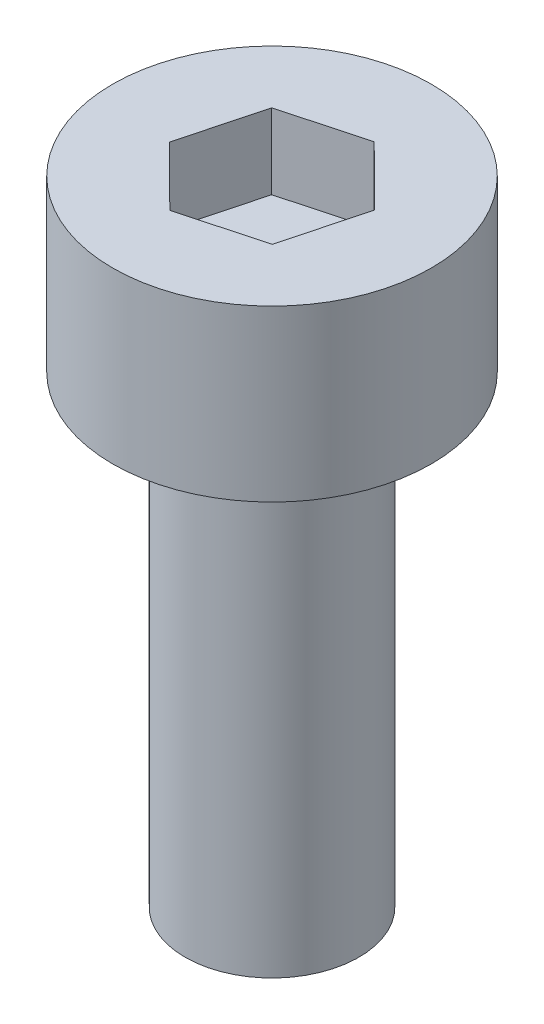
ISO-10303-21;
HEADER;
FILE_DESCRIPTION(('STEP AP214'),'2;1');
FILE_NAME('part.step','',(''),(''),'','','');
FILE_SCHEMA(('AUTOMOTIVE_DESIGN { 1 0 10303 214 1 1 1 1 }'));
ENDSEC;
DATA;
#1=APPLICATION_CONTEXT('core data for automotive mechanical design processes');
#2=APPLICATION_PROTOCOL_DEFINITION('international standard','automotive_design',2000,#1);
#3=PRODUCT_CONTEXT('',#1,'mechanical');
#4=PRODUCT('Part','Part','',(#3));
#5=PRODUCT_RELATED_PRODUCT_CATEGORY('part','',(#4));
#6=PRODUCT_DEFINITION_FORMATION('','',#4);
#7=PRODUCT_DEFINITION_CONTEXT('part definition',#1,'design');
#8=PRODUCT_DEFINITION('design','',#6,#7);
#9=PRODUCT_DEFINITION_SHAPE('','',#8);
#10=(LENGTH_UNIT() NAMED_UNIT(*) SI_UNIT(.MILLI.,.METRE.));
#11=(NAMED_UNIT(*) PLANE_ANGLE_UNIT() SI_UNIT($,.RADIAN.));
#12=(NAMED_UNIT(*) SI_UNIT($,.STERADIAN.) SOLID_ANGLE_UNIT());
#13=UNCERTAINTY_MEASURE_WITH_UNIT(LENGTH_MEASURE(1.E-05),#10,'distance_accuracy_value','');
#14=(GEOMETRIC_REPRESENTATION_CONTEXT(3) GLOBAL_UNCERTAINTY_ASSIGNED_CONTEXT((#13)) GLOBAL_UNIT_ASSIGNED_CONTEXT((#10,
#11,#12)) REPRESENTATION_CONTEXT('',''));
#15=CARTESIAN_POINT('',(0.,0.,0.));
#16=DIRECTION('',(0.,0.,1.));
#17=DIRECTION('',(1.,0.,0.));
#18=AXIS2_PLACEMENT_3D('',#15,#16,#17);
#19=CARTESIAN_POINT('',(0.,8.,0.));
#20=DIRECTION('',(0.,-1.,0.));
#21=DIRECTION('',(0.,0.,-1.));
#22=AXIS2_PLACEMENT_3D('',#19,#20,#21);
#23=CYLINDRICAL_SURFACE('',#22,1.5);
#24=CARTESIAN_POINT('',(0.,8.,0.));
#25=DIRECTION('',(0.,1.,0.));
#26=DIRECTION('',(0.,0.,1.));
#27=AXIS2_PLACEMENT_3D('',#24,#25,#26);
#28=CIRCLE('',#27,1.5);
#29=CARTESIAN_POINT('',(0.,8.,1.5));
#30=VERTEX_POINT('',#29);
#31=EDGE_CURVE('E11',#30,#30,#28,.T.);
#32=ORIENTED_EDGE('',*,*,#31,.F.);
#33=EDGE_LOOP('',(#32));
#34=FACE_BOUND('',#33,.T.);
#35=CARTESIAN_POINT('',(0.,0.,0.));
#36=DIRECTION('',(0.,1.,0.));
#37=DIRECTION('',(0.,0.,1.));
#38=AXIS2_PLACEMENT_3D('',#35,#36,#37);
#39=CIRCLE('',#38,1.5);
#40=CARTESIAN_POINT('',(0.,0.,1.5));
#41=VERTEX_POINT('',#40);
#42=EDGE_CURVE('E42',#41,#41,#39,.T.);
#43=ORIENTED_EDGE('',*,*,#42,.T.);
#44=EDGE_LOOP('',(#43));
#45=FACE_BOUND('',#44,.T.);
#46=ADVANCED_FACE('F39',(#34,#45),#23,.T.);
#47=CARTESIAN_POINT('',(0.,0.,0.));
#48=DIRECTION('',(0.,1.,0.));
#49=DIRECTION('',(0.,0.,1.));
#50=AXIS2_PLACEMENT_3D('',#47,#48,#49);
#51=PLANE('',#50);
#52=ORIENTED_EDGE('',*,*,#42,.F.);
#53=EDGE_LOOP('',(#52));
#54=FACE_BOUND('',#53,.T.);
#55=ADVANCED_FACE('F189',(#54),#51,.F.);
#56=CARTESIAN_POINT('',(0.,10.93,0.));
#57=DIRECTION('',(0.,-1.,0.));
#58=DIRECTION('',(0.,0.,-1.));
#59=AXIS2_PLACEMENT_3D('',#56,#57,#58);
#60=CYLINDRICAL_SURFACE('',#59,2.75);
#61=CARTESIAN_POINT('',(0.,10.93,0.));
#62=DIRECTION('',(0.,1.,0.));
#63=DIRECTION('',(0.,0.,1.));
#64=AXIS2_PLACEMENT_3D('',#61,#62,#63);
#65=CIRCLE('',#64,2.75);
#66=CARTESIAN_POINT('',(0.,10.93,2.75));
#67=VERTEX_POINT('',#66);
#68=EDGE_CURVE('E163',#67,#67,#65,.T.);
#69=ORIENTED_EDGE('',*,*,#68,.F.);
#70=EDGE_LOOP('',(#69));
#71=FACE_BOUND('',#70,.T.);
#72=CARTESIAN_POINT('',(0.,8.,0.));
#73=DIRECTION('',(0.,1.,0.));
#74=DIRECTION('',(0.,0.,1.));
#75=AXIS2_PLACEMENT_3D('',#72,#73,#74);
#76=CIRCLE('',#75,2.75);
#77=CARTESIAN_POINT('',(0.,8.,2.75));
#78=VERTEX_POINT('',#77);
#79=EDGE_CURVE('E153',#78,#78,#76,.T.);
#80=ORIENTED_EDGE('',*,*,#79,.T.);
#81=EDGE_LOOP('',(#80));
#82=FACE_BOUND('',#81,.T.);
#83=ADVANCED_FACE('F171',(#71,#82),#60,.T.);
#84=CARTESIAN_POINT('',(0.,10.93,0.));
#85=DIRECTION('',(0.,1.,0.));
#86=DIRECTION('',(0.,0.,1.));
#87=AXIS2_PLACEMENT_3D('',#84,#85,#86);
#88=PLANE('',#87);
#89=DIRECTION('',(0.965060636483616,0.,-0.262026654960595));
#90=VECTOR('',#89,1.);
#91=CARTESIAN_POINT('',(-0.368939204121915,10.93,1.39542724532497));
#92=LINE('',#91,#90);
#93=CARTESIAN_POINT('',(-0.368939204121915,10.93,1.39542724532497));
#94=VERTEX_POINT('',#93);
#95=CARTESIAN_POINT('',(1.0240058415234,10.93,1.01722434588407));
#96=VERTEX_POINT('',#95);
#97=EDGE_CURVE('E54',#94,#96,#92,.T.);
#98=ORIENTED_EDGE('',*,*,#97,.F.);
#99=DIRECTION('',(0.709452057906343,0.,0.704753699906893));
#100=VECTOR('',#99,1.);
#101=CARTESIAN_POINT('',(-1.39294504564532,10.93,0.378202899440891));
#102=LINE('',#101,#100);
#103=CARTESIAN_POINT('',(-1.39294504564532,10.93,0.378202899440891));
#104=VERTEX_POINT('',#103);
#105=EDGE_CURVE('E147',#104,#94,#102,.T.);
#106=ORIENTED_EDGE('',*,*,#105,.F.);
#107=DIRECTION('',(-0.255608578577273,0.,0.966780354867488));
#108=VECTOR('',#107,1.);
#109=CARTESIAN_POINT('',(-1.0240058415234,10.93,-1.01722434588407));
#110=LINE('',#109,#108);
#111=CARTESIAN_POINT('',(-1.0240058415234,10.93,-1.01722434588407));
#112=VERTEX_POINT('',#111);
#113=EDGE_CURVE('E144',#112,#104,#110,.T.);
#114=ORIENTED_EDGE('',*,*,#113,.F.);
#115=DIRECTION('',(-0.965060636483616,0.,0.262026654960595));
#116=VECTOR('',#115,1.);
#117=CARTESIAN_POINT('',(0.368939204121915,10.93,-1.39542724532496));
#118=LINE('',#117,#116);
#119=CARTESIAN_POINT('',(0.368939204121915,10.93,-1.39542724532496));
#120=VERTEX_POINT('',#119);
#121=EDGE_CURVE('E102',#120,#112,#118,.T.);
#122=ORIENTED_EDGE('',*,*,#121,.F.);
#123=DIRECTION('',(-0.709452057906343,0.,-0.704753699906893));
#124=VECTOR('',#123,1.);
#125=CARTESIAN_POINT('',(1.39294504564532,10.93,-0.378202899440891));
#126=LINE('',#125,#124);
#127=CARTESIAN_POINT('',(1.39294504564532,10.93,-0.378202899440891));
#128=VERTEX_POINT('',#127);
#129=EDGE_CURVE('E138',#128,#120,#126,.T.);
#130=ORIENTED_EDGE('',*,*,#129,.F.);
#131=DIRECTION('',(0.255608578577273,0.,-0.966780354867488));
#132=VECTOR('',#131,1.);
#133=CARTESIAN_POINT('',(1.0240058415234,10.93,1.01722434588407));
#134=LINE('',#133,#132);
#135=EDGE_CURVE('E134',#96,#128,#134,.T.);
#136=ORIENTED_EDGE('',*,*,#135,.F.);
#137=EDGE_LOOP('',(#98,#106,#114,#122,#130,#136));
#138=FACE_BOUND('',#137,.T.);
#139=ORIENTED_EDGE('',*,*,#68,.T.);
#140=EDGE_LOOP('',(#139));
#141=FACE_BOUND('',#140,.T.);
#142=ADVANCED_FACE('F176',(#138,#141),#88,.T.);
#143=CARTESIAN_POINT('',(0.,8.,0.));
#144=DIRECTION('',(0.,1.,0.));
#145=DIRECTION('',(0.,0.,1.));
#146=AXIS2_PLACEMENT_3D('',#143,#144,#145);
#147=PLANE('',#146);
#148=ORIENTED_EDGE('',*,*,#31,.T.);
#149=EDGE_LOOP('',(#148));
#150=FACE_BOUND('',#149,.T.);
#151=ORIENTED_EDGE('',*,*,#79,.F.);
#152=EDGE_LOOP('',(#151));
#153=FACE_BOUND('',#152,.T.);
#154=ADVANCED_FACE('F173',(#150,#153),#147,.F.);
#155=CARTESIAN_POINT('',(-0.368939204121915,9.63,1.39542724532497));
#156=DIRECTION('',(0.262026654960595,0.,0.965060636483616));
#157=DIRECTION('',(0.965060636483616,0.,-0.262026654960595));
#158=AXIS2_PLACEMENT_3D('',#155,#156,#157);
#159=PLANE('',#158);
#160=ORIENTED_EDGE('',*,*,#97,.T.);
#161=DIRECTION('',(0.,1.,0.));
#162=VECTOR('',#161,1.);
#163=CARTESIAN_POINT('',(1.0240058415234,9.63,1.01722434588407));
#164=LINE('',#163,#162);
#165=CARTESIAN_POINT('',(1.0240058415234,9.63,1.01722434588407));
#166=VERTEX_POINT('',#165);
#167=EDGE_CURVE('E84',#166,#96,#164,.T.);
#168=ORIENTED_EDGE('',*,*,#167,.F.);
#169=DIRECTION('',(0.965060636483616,0.,-0.262026654960595));
#170=VECTOR('',#169,1.);
#171=CARTESIAN_POINT('',(-0.368939204121915,9.63,1.39542724532497));
#172=LINE('',#171,#170);
#173=CARTESIAN_POINT('',(-0.368939204121915,9.63,1.39542724532497));
#174=VERTEX_POINT('',#173);
#175=EDGE_CURVE('E150',#174,#166,#172,.T.);
#176=ORIENTED_EDGE('',*,*,#175,.F.);
#177=DIRECTION('',(0.,1.,0.));
#178=VECTOR('',#177,1.);
#179=CARTESIAN_POINT('',(-0.368939204121915,9.63,1.39542724532497));
#180=LINE('',#179,#178);
#181=EDGE_CURVE('E62',#174,#94,#180,.T.);
#182=ORIENTED_EDGE('',*,*,#181,.T.);
#183=EDGE_LOOP('',(#160,#168,#176,#182));
#184=FACE_BOUND('',#183,.T.);
#185=ADVANCED_FACE('F175',(#184),#159,.F.);
#186=CARTESIAN_POINT('',(-1.39294504564532,9.63,0.378202899440891));
#187=DIRECTION('',(-0.704753699906893,0.,0.709452057906343));
#188=DIRECTION('',(0.709452057906343,0.,0.704753699906893));
#189=AXIS2_PLACEMENT_3D('',#186,#187,#188);
#190=PLANE('',#189);
#191=ORIENTED_EDGE('',*,*,#105,.T.);
#192=ORIENTED_EDGE('',*,*,#181,.F.);
#193=DIRECTION('',(0.709452057906343,0.,0.704753699906893));
#194=VECTOR('',#193,1.);
#195=CARTESIAN_POINT('',(-1.39294504564532,9.63,0.378202899440891));
#196=LINE('',#195,#194);
#197=CARTESIAN_POINT('',(-1.39294504564532,9.63,0.378202899440891));
#198=VERTEX_POINT('',#197);
#199=EDGE_CURVE('E116',#198,#174,#196,.T.);
#200=ORIENTED_EDGE('',*,*,#199,.F.);
#201=DIRECTION('',(0.,1.,0.));
#202=VECTOR('',#201,1.);
#203=CARTESIAN_POINT('',(-1.39294504564532,9.63,0.378202899440891));
#204=LINE('',#203,#202);
#205=EDGE_CURVE('E107',#198,#104,#204,.T.);
#206=ORIENTED_EDGE('',*,*,#205,.T.);
#207=EDGE_LOOP('',(#191,#192,#200,#206));
#208=FACE_BOUND('',#207,.T.);
#209=ADVANCED_FACE('F183',(#208),#190,.F.);
#210=CARTESIAN_POINT('',(-1.0240058415234,9.63,-1.01722434588407));
#211=DIRECTION('',(-0.966780354867488,0.,-0.255608578577273));
#212=DIRECTION('',(-0.255608578577273,0.,0.966780354867488));
#213=AXIS2_PLACEMENT_3D('',#210,#211,#212);
#214=PLANE('',#213);
#215=ORIENTED_EDGE('',*,*,#113,.T.);
#216=ORIENTED_EDGE('',*,*,#205,.F.);
#217=DIRECTION('',(-0.255608578577273,0.,0.966780354867488));
#218=VECTOR('',#217,1.);
#219=CARTESIAN_POINT('',(-1.0240058415234,9.63,-1.01722434588407));
#220=LINE('',#219,#218);
#221=CARTESIAN_POINT('',(-1.0240058415234,9.63,-1.01722434588407));
#222=VERTEX_POINT('',#221);
#223=EDGE_CURVE('E111',#222,#198,#220,.T.);
#224=ORIENTED_EDGE('',*,*,#223,.F.);
#225=DIRECTION('',(0.,1.,0.));
#226=VECTOR('',#225,1.);
#227=CARTESIAN_POINT('',(-1.0240058415234,9.63,-1.01722434588407));
#228=LINE('',#227,#226);
#229=EDGE_CURVE('E95',#222,#112,#228,.T.);
#230=ORIENTED_EDGE('',*,*,#229,.T.);
#231=EDGE_LOOP('',(#215,#216,#224,#230));
#232=FACE_BOUND('',#231,.T.);
#233=ADVANCED_FACE('F112',(#232),#214,.F.);
#234=CARTESIAN_POINT('',(0.368939204121915,9.63,-1.39542724532496));
#235=DIRECTION('',(-0.262026654960595,0.,-0.965060636483616));
#236=DIRECTION('',(-0.965060636483616,0.,0.262026654960595));
#237=AXIS2_PLACEMENT_3D('',#234,#235,#236);
#238=PLANE('',#237);
#239=ORIENTED_EDGE('',*,*,#121,.T.);
#240=ORIENTED_EDGE('',*,*,#229,.F.);
#241=DIRECTION('',(-0.965060636483616,0.,0.262026654960595));
#242=VECTOR('',#241,1.);
#243=CARTESIAN_POINT('',(0.368939204121915,9.63,-1.39542724532496));
#244=LINE('',#243,#242);
#245=CARTESIAN_POINT('',(0.368939204121915,9.63,-1.39542724532496));
#246=VERTEX_POINT('',#245);
#247=EDGE_CURVE('E99',#246,#222,#244,.T.);
#248=ORIENTED_EDGE('',*,*,#247,.F.);
#249=DIRECTION('',(0.,1.,0.));
#250=VECTOR('',#249,1.);
#251=CARTESIAN_POINT('',(0.368939204121915,9.63,-1.39542724532496));
#252=LINE('',#251,#250);
#253=EDGE_CURVE('E108',#246,#120,#252,.T.);
#254=ORIENTED_EDGE('',*,*,#253,.T.);
#255=EDGE_LOOP('',(#239,#240,#248,#254));
#256=FACE_BOUND('',#255,.T.);
#257=ADVANCED_FACE('F97',(#256),#238,.F.);
#258=CARTESIAN_POINT('',(1.39294504564532,9.63,-0.378202899440891));
#259=DIRECTION('',(0.704753699906893,0.,-0.709452057906343));
#260=DIRECTION('',(-0.709452057906343,0.,-0.704753699906893));
#261=AXIS2_PLACEMENT_3D('',#258,#259,#260);
#262=PLANE('',#261);
#263=ORIENTED_EDGE('',*,*,#129,.T.);
#264=ORIENTED_EDGE('',*,*,#253,.F.);
#265=DIRECTION('',(-0.709452057906343,0.,-0.704753699906893));
#266=VECTOR('',#265,1.);
#267=CARTESIAN_POINT('',(1.39294504564532,9.63,-0.378202899440891));
#268=LINE('',#267,#266);
#269=CARTESIAN_POINT('',(1.39294504564532,9.63,-0.378202899440891));
#270=VERTEX_POINT('',#269);
#271=EDGE_CURVE('E122',#270,#246,#268,.T.);
#272=ORIENTED_EDGE('',*,*,#271,.F.);
#273=DIRECTION('',(0.,1.,0.));
#274=VECTOR('',#273,1.);
#275=CARTESIAN_POINT('',(1.39294504564532,9.63,-0.378202899440891));
#276=LINE('',#275,#274);
#277=EDGE_CURVE('E158',#270,#128,#276,.T.);
#278=ORIENTED_EDGE('',*,*,#277,.T.);
#279=EDGE_LOOP('',(#263,#264,#272,#278));
#280=FACE_BOUND('',#279,.T.);
#281=ADVANCED_FACE('F245',(#280),#262,.F.);
#282=CARTESIAN_POINT('',(1.0240058415234,9.63,1.01722434588407));
#283=DIRECTION('',(0.966780354867488,0.,0.255608578577273));
#284=DIRECTION('',(0.255608578577273,0.,-0.966780354867488));
#285=AXIS2_PLACEMENT_3D('',#282,#283,#284);
#286=PLANE('',#285);
#287=ORIENTED_EDGE('',*,*,#135,.T.);
#288=ORIENTED_EDGE('',*,*,#277,.F.);
#289=DIRECTION('',(0.255608578577273,0.,-0.966780354867488));
#290=VECTOR('',#289,1.);
#291=CARTESIAN_POINT('',(1.0240058415234,9.63,1.01722434588407));
#292=LINE('',#291,#290);
#293=EDGE_CURVE('E126',#166,#270,#292,.T.);
#294=ORIENTED_EDGE('',*,*,#293,.F.);
#295=ORIENTED_EDGE('',*,*,#167,.T.);
#296=EDGE_LOOP('',(#287,#288,#294,#295));
#297=FACE_BOUND('',#296,.T.);
#298=ADVANCED_FACE('F254',(#297),#286,.F.);
#299=CARTESIAN_POINT('',(0.,9.63,0.));
#300=DIRECTION('',(0.,1.,0.));
#301=DIRECTION('',(0.,0.,1.));
#302=AXIS2_PLACEMENT_3D('',#299,#300,#301);
#303=PLANE('',#302);
#304=ORIENTED_EDGE('',*,*,#175,.T.);
#305=ORIENTED_EDGE('',*,*,#293,.T.);
#306=ORIENTED_EDGE('',*,*,#271,.T.);
#307=ORIENTED_EDGE('',*,*,#247,.T.);
#308=ORIENTED_EDGE('',*,*,#223,.T.);
#309=ORIENTED_EDGE('',*,*,#199,.T.);
#310=EDGE_LOOP('',(#304,#305,#306,#307,#308,#309));
#311=FACE_BOUND('',#310,.T.);
#312=ADVANCED_FACE('F119',(#311),#303,.T.);
#313=CLOSED_SHELL('',(#46,#55,#83,#142,#154,#185,#209,#233,#257,#281,#298,#312));
#314=MANIFOLD_SOLID_BREP('B2',#313);
#315=ADVANCED_BREP_SHAPE_REPRESENTATION('',(#18,#314),#14);
#316=SHAPE_DEFINITION_REPRESENTATION(#9,#315);
ENDSEC;
END-ISO-10303-21;
